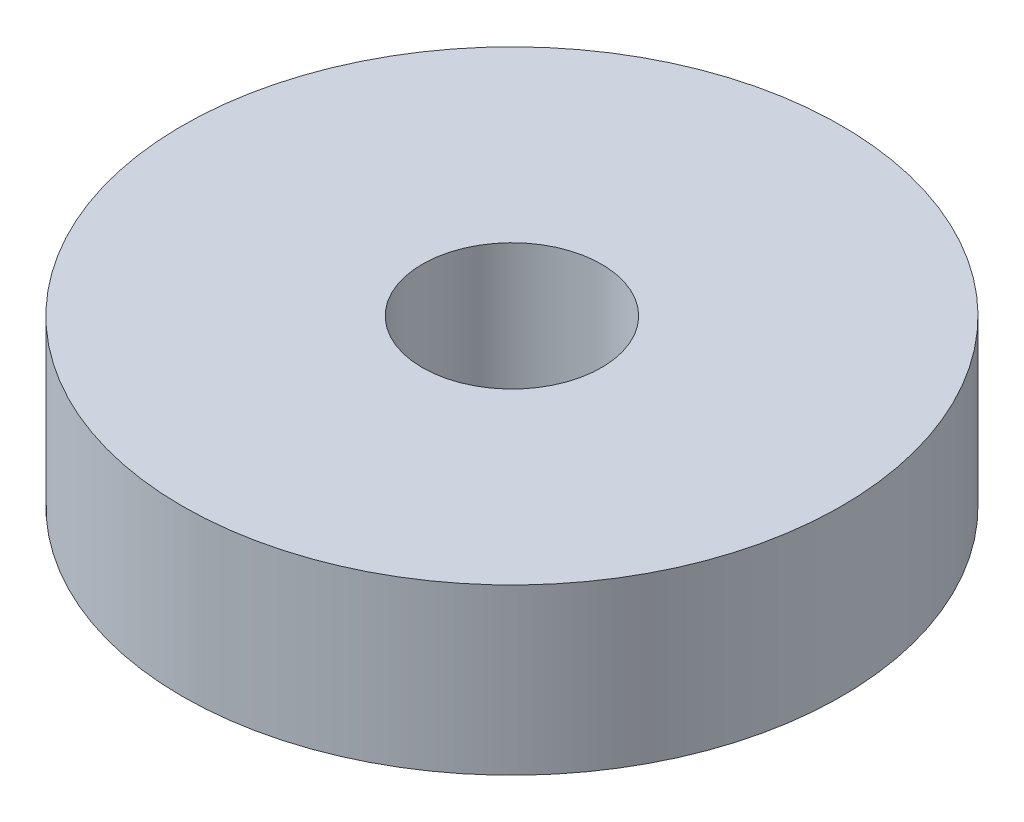
ISO-10303-21;
HEADER;
FILE_DESCRIPTION(('STEP AP214'),'2;1');
FILE_NAME('part.step','',(''),(''),'','','');
FILE_SCHEMA(('AUTOMOTIVE_DESIGN { 1 0 10303 214 1 1 1 1 }'));
ENDSEC;
DATA;
#1=APPLICATION_CONTEXT('core data for automotive mechanical design processes');
#2=APPLICATION_PROTOCOL_DEFINITION('international standard','automotive_design',2000,#1);
#3=PRODUCT_CONTEXT('',#1,'mechanical');
#4=PRODUCT('Part','Part','',(#3));
#5=PRODUCT_RELATED_PRODUCT_CATEGORY('part','',(#4));
#6=PRODUCT_DEFINITION_FORMATION('','',#4);
#7=PRODUCT_DEFINITION_CONTEXT('part definition',#1,'design');
#8=PRODUCT_DEFINITION('design','',#6,#7);
#9=PRODUCT_DEFINITION_SHAPE('','',#8);
#10=(LENGTH_UNIT() NAMED_UNIT(*) SI_UNIT(.MILLI.,.METRE.));
#11=(NAMED_UNIT(*) PLANE_ANGLE_UNIT() SI_UNIT($,.RADIAN.));
#12=(NAMED_UNIT(*) SI_UNIT($,.STERADIAN.) SOLID_ANGLE_UNIT());
#13=UNCERTAINTY_MEASURE_WITH_UNIT(LENGTH_MEASURE(1.E-05),#10,'distance_accuracy_value','');
#14=(GEOMETRIC_REPRESENTATION_CONTEXT(3) GLOBAL_UNCERTAINTY_ASSIGNED_CONTEXT((#13)) GLOBAL_UNIT_ASSIGNED_CONTEXT((#10,
#11,#12)) REPRESENTATION_CONTEXT('',''));
#15=CARTESIAN_POINT('',(0.,0.,0.));
#16=DIRECTION('',(0.,0.,1.));
#17=DIRECTION('',(1.,0.,0.));
#18=AXIS2_PLACEMENT_3D('',#15,#16,#17);
#19=CARTESIAN_POINT('',(0.,3.175,0.));
#20=DIRECTION('',(0.,1.,0.));
#21=DIRECTION('',(0.,0.,1.));
#22=AXIS2_PLACEMENT_3D('',#19,#20,#21);
#23=PLANE('',#22);
#24=CARTESIAN_POINT('',(0.,3.175,0.));
#25=DIRECTION('',(0.,1.,0.));
#26=DIRECTION('',(0.,0.,1.));
#27=AXIS2_PLACEMENT_3D('',#24,#25,#26);
#28=CIRCLE('',#27,1.72719999999999);
#29=CARTESIAN_POINT('',(0.,3.175,1.72719999999999));
#30=VERTEX_POINT('',#29);
#31=EDGE_CURVE('E62',#30,#30,#28,.T.);
#32=ORIENTED_EDGE('',*,*,#31,.F.);
#33=EDGE_LOOP('',(#32));
#34=FACE_BOUND('',#33,.T.);
#35=CARTESIAN_POINT('',(0.,3.175,0.));
#36=DIRECTION('',(0.,1.,0.));
#37=DIRECTION('',(0.,0.,1.));
#38=AXIS2_PLACEMENT_3D('',#35,#36,#37);
#39=CIRCLE('',#38,6.35);
#40=CARTESIAN_POINT('',(0.,3.175,6.35));
#41=VERTEX_POINT('',#40);
#42=EDGE_CURVE('E12',#41,#41,#39,.T.);
#43=ORIENTED_EDGE('',*,*,#42,.T.);
#44=EDGE_LOOP('',(#43));
#45=FACE_BOUND('',#44,.T.);
#46=ADVANCED_FACE('F47',(#34,#45),#23,.T.);
#47=CARTESIAN_POINT('',(0.,0.,0.));
#48=DIRECTION('',(0.,1.,0.));
#49=DIRECTION('',(0.,0.,1.));
#50=AXIS2_PLACEMENT_3D('',#47,#48,#49);
#51=PLANE('',#50);
#52=CARTESIAN_POINT('',(0.,0.,0.));
#53=DIRECTION('',(0.,1.,0.));
#54=DIRECTION('',(0.,0.,1.));
#55=AXIS2_PLACEMENT_3D('',#52,#53,#54);
#56=CIRCLE('',#55,1.7272);
#57=CARTESIAN_POINT('',(0.,0.,1.7272));
#58=VERTEX_POINT('',#57);
#59=EDGE_CURVE('E58',#58,#58,#56,.T.);
#60=ORIENTED_EDGE('',*,*,#59,.T.);
#61=EDGE_LOOP('',(#60));
#62=FACE_BOUND('',#61,.T.);
#63=CARTESIAN_POINT('',(0.,0.,0.));
#64=DIRECTION('',(0.,1.,0.));
#65=DIRECTION('',(0.,0.,1.));
#66=AXIS2_PLACEMENT_3D('',#63,#64,#65);
#67=CIRCLE('',#66,6.35);
#68=CARTESIAN_POINT('',(0.,0.,6.35));
#69=VERTEX_POINT('',#68);
#70=EDGE_CURVE('E51',#69,#69,#67,.T.);
#71=ORIENTED_EDGE('',*,*,#70,.F.);
#72=EDGE_LOOP('',(#71));
#73=FACE_BOUND('',#72,.T.);
#74=ADVANCED_FACE('F69',(#62,#73),#51,.F.);
#75=CARTESIAN_POINT('',(0.,3.175,0.));
#76=DIRECTION('',(0.,-1.,0.));
#77=DIRECTION('',(0.,0.,-1.));
#78=AXIS2_PLACEMENT_3D('',#75,#76,#77);
#79=CYLINDRICAL_SURFACE('',#78,6.35);
#80=ORIENTED_EDGE('',*,*,#42,.F.);
#81=EDGE_LOOP('',(#80));
#82=FACE_BOUND('',#81,.T.);
#83=ORIENTED_EDGE('',*,*,#70,.T.);
#84=EDGE_LOOP('',(#83));
#85=FACE_BOUND('',#84,.T.);
#86=ADVANCED_FACE('F49',(#82,#85),#79,.T.);
#87=CARTESIAN_POINT('',(0.,3.175,0.));
#88=DIRECTION('',(0.,1.,0.));
#89=DIRECTION('',(0.,0.,1.));
#90=AXIS2_PLACEMENT_3D('',#87,#88,#89);
#91=CYLINDRICAL_SURFACE('',#90,1.72719999999999);
#92=ORIENTED_EDGE('',*,*,#59,.F.);
#93=EDGE_LOOP('',(#92));
#94=FACE_BOUND('',#93,.T.);
#95=ORIENTED_EDGE('',*,*,#31,.T.);
#96=EDGE_LOOP('',(#95));
#97=FACE_BOUND('',#96,.T.);
#98=ADVANCED_FACE('F66',(#94,#97),#91,.F.);
#99=CLOSED_SHELL('',(#46,#74,#86,#98));
#100=MANIFOLD_SOLID_BREP('B2',#99);
#101=ADVANCED_BREP_SHAPE_REPRESENTATION('',(#18,#100),#14);
#102=SHAPE_DEFINITION_REPRESENTATION(#9,#101);
ENDSEC;
END-ISO-10303-21;
